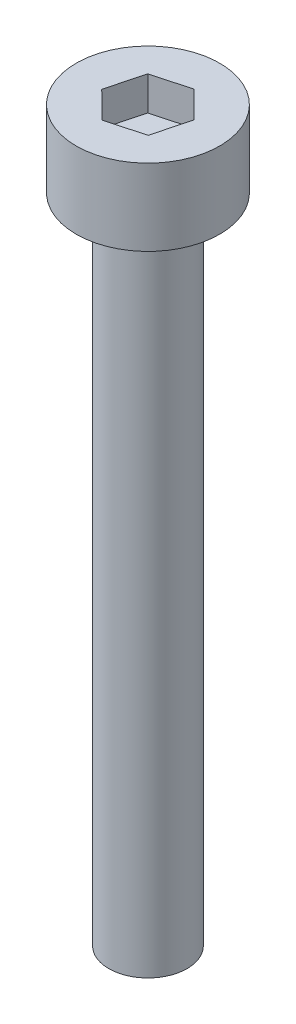
ISO-10303-21;
HEADER;
FILE_DESCRIPTION(('STEP AP214'),'2;1');
FILE_NAME('part.step','',(''),(''),'','','');
FILE_SCHEMA(('AUTOMOTIVE_DESIGN { 1 0 10303 214 1 1 1 1 }'));
ENDSEC;
DATA;
#1=APPLICATION_CONTEXT('core data for automotive mechanical design processes');
#2=APPLICATION_PROTOCOL_DEFINITION('international standard','automotive_design',2000,#1);
#3=PRODUCT_CONTEXT('',#1,'mechanical');
#4=PRODUCT('Part','Part','',(#3));
#5=PRODUCT_RELATED_PRODUCT_CATEGORY('part','',(#4));
#6=PRODUCT_DEFINITION_FORMATION('','',#4);
#7=PRODUCT_DEFINITION_CONTEXT('part definition',#1,'design');
#8=PRODUCT_DEFINITION('design','',#6,#7);
#9=PRODUCT_DEFINITION_SHAPE('','',#8);
#10=(LENGTH_UNIT() NAMED_UNIT(*) SI_UNIT(.MILLI.,.METRE.));
#11=(NAMED_UNIT(*) PLANE_ANGLE_UNIT() SI_UNIT($,.RADIAN.));
#12=(NAMED_UNIT(*) SI_UNIT($,.STERADIAN.) SOLID_ANGLE_UNIT());
#13=UNCERTAINTY_MEASURE_WITH_UNIT(LENGTH_MEASURE(1.E-05),#10,'distance_accuracy_value','');
#14=(GEOMETRIC_REPRESENTATION_CONTEXT(3) GLOBAL_UNCERTAINTY_ASSIGNED_CONTEXT((#13)) GLOBAL_UNIT_ASSIGNED_CONTEXT((#10,
#11,#12)) REPRESENTATION_CONTEXT('',''));
#15=CARTESIAN_POINT('',(0.,0.,0.));
#16=DIRECTION('',(0.,0.,1.));
#17=DIRECTION('',(1.,0.,0.));
#18=AXIS2_PLACEMENT_3D('',#15,#16,#17);
#19=CARTESIAN_POINT('',(0.,25.,0.));
#20=DIRECTION('',(0.,-1.,0.));
#21=DIRECTION('',(0.,0.,-1.));
#22=AXIS2_PLACEMENT_3D('',#19,#20,#21);
#23=CYLINDRICAL_SURFACE('',#22,1.5);
#24=CARTESIAN_POINT('',(0.,25.,0.));
#25=DIRECTION('',(0.,1.,0.));
#26=DIRECTION('',(0.,0.,1.));
#27=AXIS2_PLACEMENT_3D('',#24,#25,#26);
#28=CIRCLE('',#27,1.5);
#29=CARTESIAN_POINT('',(0.,25.,1.5));
#30=VERTEX_POINT('',#29);
#31=EDGE_CURVE('E11',#30,#30,#28,.T.);
#32=ORIENTED_EDGE('',*,*,#31,.F.);
#33=EDGE_LOOP('',(#32));
#34=FACE_BOUND('',#33,.T.);
#35=CARTESIAN_POINT('',(0.,0.,0.));
#36=DIRECTION('',(0.,1.,0.));
#37=DIRECTION('',(0.,0.,1.));
#38=AXIS2_PLACEMENT_3D('',#35,#36,#37);
#39=CIRCLE('',#38,1.5);
#40=CARTESIAN_POINT('',(0.,0.,1.5));
#41=VERTEX_POINT('',#40);
#42=EDGE_CURVE('E42',#41,#41,#39,.T.);
#43=ORIENTED_EDGE('',*,*,#42,.T.);
#44=EDGE_LOOP('',(#43));
#45=FACE_BOUND('',#44,.T.);
#46=ADVANCED_FACE('F39',(#34,#45),#23,.T.);
#47=CARTESIAN_POINT('',(0.,0.,0.));
#48=DIRECTION('',(0.,1.,0.));
#49=DIRECTION('',(0.,0.,1.));
#50=AXIS2_PLACEMENT_3D('',#47,#48,#49);
#51=PLANE('',#50);
#52=ORIENTED_EDGE('',*,*,#42,.F.);
#53=EDGE_LOOP('',(#52));
#54=FACE_BOUND('',#53,.T.);
#55=ADVANCED_FACE('F189',(#54),#51,.F.);
#56=CARTESIAN_POINT('',(0.,27.93,0.));
#57=DIRECTION('',(0.,-1.,0.));
#58=DIRECTION('',(0.,0.,-1.));
#59=AXIS2_PLACEMENT_3D('',#56,#57,#58);
#60=CYLINDRICAL_SURFACE('',#59,2.75);
#61=CARTESIAN_POINT('',(0.,27.93,0.));
#62=DIRECTION('',(0.,1.,0.));
#63=DIRECTION('',(0.,0.,1.));
#64=AXIS2_PLACEMENT_3D('',#61,#62,#63);
#65=CIRCLE('',#64,2.75);
#66=CARTESIAN_POINT('',(0.,27.93,2.75));
#67=VERTEX_POINT('',#66);
#68=EDGE_CURVE('E163',#67,#67,#65,.T.);
#69=ORIENTED_EDGE('',*,*,#68,.F.);
#70=EDGE_LOOP('',(#69));
#71=FACE_BOUND('',#70,.T.);
#72=CARTESIAN_POINT('',(0.,25.,0.));
#73=DIRECTION('',(0.,1.,0.));
#74=DIRECTION('',(0.,0.,1.));
#75=AXIS2_PLACEMENT_3D('',#72,#73,#74);
#76=CIRCLE('',#75,2.75);
#77=CARTESIAN_POINT('',(0.,25.,2.75));
#78=VERTEX_POINT('',#77);
#79=EDGE_CURVE('E153',#78,#78,#76,.T.);
#80=ORIENTED_EDGE('',*,*,#79,.T.);
#81=EDGE_LOOP('',(#80));
#82=FACE_BOUND('',#81,.T.);
#83=ADVANCED_FACE('F171',(#71,#82),#60,.T.);
#84=CARTESIAN_POINT('',(0.,27.93,0.));
#85=DIRECTION('',(0.,1.,0.));
#86=DIRECTION('',(0.,0.,1.));
#87=AXIS2_PLACEMENT_3D('',#84,#85,#86);
#88=PLANE('',#87);
#89=DIRECTION('',(0.965060636483616,0.,-0.262026654960595));
#90=VECTOR('',#89,1.);
#91=CARTESIAN_POINT('',(-0.368939204121915,27.93,1.39542724532497));
#92=LINE('',#91,#90);
#93=CARTESIAN_POINT('',(-0.368939204121915,27.93,1.39542724532497));
#94=VERTEX_POINT('',#93);
#95=CARTESIAN_POINT('',(1.0240058415234,27.93,1.01722434588407));
#96=VERTEX_POINT('',#95);
#97=EDGE_CURVE('E54',#94,#96,#92,.T.);
#98=ORIENTED_EDGE('',*,*,#97,.F.);
#99=DIRECTION('',(0.709452057906343,0.,0.704753699906893));
#100=VECTOR('',#99,1.);
#101=CARTESIAN_POINT('',(-1.39294504564532,27.93,0.378202899440891));
#102=LINE('',#101,#100);
#103=CARTESIAN_POINT('',(-1.39294504564532,27.93,0.378202899440891));
#104=VERTEX_POINT('',#103);
#105=EDGE_CURVE('E147',#104,#94,#102,.T.);
#106=ORIENTED_EDGE('',*,*,#105,.F.);
#107=DIRECTION('',(-0.255608578577273,0.,0.966780354867488));
#108=VECTOR('',#107,1.);
#109=CARTESIAN_POINT('',(-1.0240058415234,27.93,-1.01722434588407));
#110=LINE('',#109,#108);
#111=CARTESIAN_POINT('',(-1.0240058415234,27.93,-1.01722434588407));
#112=VERTEX_POINT('',#111);
#113=EDGE_CURVE('E144',#112,#104,#110,.T.);
#114=ORIENTED_EDGE('',*,*,#113,.F.);
#115=DIRECTION('',(-0.965060636483616,0.,0.262026654960595));
#116=VECTOR('',#115,1.);
#117=CARTESIAN_POINT('',(0.368939204121915,27.93,-1.39542724532496));
#118=LINE('',#117,#116);
#119=CARTESIAN_POINT('',(0.368939204121915,27.93,-1.39542724532496));
#120=VERTEX_POINT('',#119);
#121=EDGE_CURVE('E102',#120,#112,#118,.T.);
#122=ORIENTED_EDGE('',*,*,#121,.F.);
#123=DIRECTION('',(-0.709452057906343,0.,-0.704753699906893));
#124=VECTOR('',#123,1.);
#125=CARTESIAN_POINT('',(1.39294504564532,27.93,-0.378202899440891));
#126=LINE('',#125,#124);
#127=CARTESIAN_POINT('',(1.39294504564532,27.93,-0.378202899440891));
#128=VERTEX_POINT('',#127);
#129=EDGE_CURVE('E138',#128,#120,#126,.T.);
#130=ORIENTED_EDGE('',*,*,#129,.F.);
#131=DIRECTION('',(0.255608578577273,0.,-0.966780354867488));
#132=VECTOR('',#131,1.);
#133=CARTESIAN_POINT('',(1.0240058415234,27.93,1.01722434588407));
#134=LINE('',#133,#132);
#135=EDGE_CURVE('E134',#96,#128,#134,.T.);
#136=ORIENTED_EDGE('',*,*,#135,.F.);
#137=EDGE_LOOP('',(#98,#106,#114,#122,#130,#136));
#138=FACE_BOUND('',#137,.T.);
#139=ORIENTED_EDGE('',*,*,#68,.T.);
#140=EDGE_LOOP('',(#139));
#141=FACE_BOUND('',#140,.T.);
#142=ADVANCED_FACE('F176',(#138,#141),#88,.T.);
#143=CARTESIAN_POINT('',(0.,25.,0.));
#144=DIRECTION('',(0.,1.,0.));
#145=DIRECTION('',(0.,0.,1.));
#146=AXIS2_PLACEMENT_3D('',#143,#144,#145);
#147=PLANE('',#146);
#148=ORIENTED_EDGE('',*,*,#31,.T.);
#149=EDGE_LOOP('',(#148));
#150=FACE_BOUND('',#149,.T.);
#151=ORIENTED_EDGE('',*,*,#79,.F.);
#152=EDGE_LOOP('',(#151));
#153=FACE_BOUND('',#152,.T.);
#154=ADVANCED_FACE('F173',(#150,#153),#147,.F.);
#155=CARTESIAN_POINT('',(-0.368939204121915,26.63,1.39542724532497));
#156=DIRECTION('',(0.262026654960595,0.,0.965060636483616));
#157=DIRECTION('',(0.965060636483616,0.,-0.262026654960595));
#158=AXIS2_PLACEMENT_3D('',#155,#156,#157);
#159=PLANE('',#158);
#160=ORIENTED_EDGE('',*,*,#97,.T.);
#161=DIRECTION('',(0.,1.,0.));
#162=VECTOR('',#161,1.);
#163=CARTESIAN_POINT('',(1.0240058415234,26.63,1.01722434588407));
#164=LINE('',#163,#162);
#165=CARTESIAN_POINT('',(1.0240058415234,26.63,1.01722434588407));
#166=VERTEX_POINT('',#165);
#167=EDGE_CURVE('E84',#166,#96,#164,.T.);
#168=ORIENTED_EDGE('',*,*,#167,.F.);
#169=DIRECTION('',(0.965060636483616,0.,-0.262026654960595));
#170=VECTOR('',#169,1.);
#171=CARTESIAN_POINT('',(-0.368939204121915,26.63,1.39542724532497));
#172=LINE('',#171,#170);
#173=CARTESIAN_POINT('',(-0.368939204121915,26.63,1.39542724532497));
#174=VERTEX_POINT('',#173);
#175=EDGE_CURVE('E150',#174,#166,#172,.T.);
#176=ORIENTED_EDGE('',*,*,#175,.F.);
#177=DIRECTION('',(0.,1.,0.));
#178=VECTOR('',#177,1.);
#179=CARTESIAN_POINT('',(-0.368939204121915,26.63,1.39542724532497));
#180=LINE('',#179,#178);
#181=EDGE_CURVE('E62',#174,#94,#180,.T.);
#182=ORIENTED_EDGE('',*,*,#181,.T.);
#183=EDGE_LOOP('',(#160,#168,#176,#182));
#184=FACE_BOUND('',#183,.T.);
#185=ADVANCED_FACE('F175',(#184),#159,.F.);
#186=CARTESIAN_POINT('',(-1.39294504564532,26.63,0.378202899440891));
#187=DIRECTION('',(-0.704753699906893,0.,0.709452057906343));
#188=DIRECTION('',(0.709452057906343,0.,0.704753699906893));
#189=AXIS2_PLACEMENT_3D('',#186,#187,#188);
#190=PLANE('',#189);
#191=ORIENTED_EDGE('',*,*,#105,.T.);
#192=ORIENTED_EDGE('',*,*,#181,.F.);
#193=DIRECTION('',(0.709452057906343,0.,0.704753699906893));
#194=VECTOR('',#193,1.);
#195=CARTESIAN_POINT('',(-1.39294504564532,26.63,0.378202899440891));
#196=LINE('',#195,#194);
#197=CARTESIAN_POINT('',(-1.39294504564532,26.63,0.378202899440891));
#198=VERTEX_POINT('',#197);
#199=EDGE_CURVE('E116',#198,#174,#196,.T.);
#200=ORIENTED_EDGE('',*,*,#199,.F.);
#201=DIRECTION('',(0.,1.,0.));
#202=VECTOR('',#201,1.);
#203=CARTESIAN_POINT('',(-1.39294504564532,26.63,0.378202899440891));
#204=LINE('',#203,#202);
#205=EDGE_CURVE('E107',#198,#104,#204,.T.);
#206=ORIENTED_EDGE('',*,*,#205,.T.);
#207=EDGE_LOOP('',(#191,#192,#200,#206));
#208=FACE_BOUND('',#207,.T.);
#209=ADVANCED_FACE('F183',(#208),#190,.F.);
#210=CARTESIAN_POINT('',(-1.0240058415234,26.63,-1.01722434588407));
#211=DIRECTION('',(-0.966780354867488,0.,-0.255608578577273));
#212=DIRECTION('',(-0.255608578577273,0.,0.966780354867488));
#213=AXIS2_PLACEMENT_3D('',#210,#211,#212);
#214=PLANE('',#213);
#215=ORIENTED_EDGE('',*,*,#113,.T.);
#216=ORIENTED_EDGE('',*,*,#205,.F.);
#217=DIRECTION('',(-0.255608578577273,0.,0.966780354867488));
#218=VECTOR('',#217,1.);
#219=CARTESIAN_POINT('',(-1.0240058415234,26.63,-1.01722434588407));
#220=LINE('',#219,#218);
#221=CARTESIAN_POINT('',(-1.0240058415234,26.63,-1.01722434588407));
#222=VERTEX_POINT('',#221);
#223=EDGE_CURVE('E111',#222,#198,#220,.T.);
#224=ORIENTED_EDGE('',*,*,#223,.F.);
#225=DIRECTION('',(0.,1.,0.));
#226=VECTOR('',#225,1.);
#227=CARTESIAN_POINT('',(-1.0240058415234,26.63,-1.01722434588407));
#228=LINE('',#227,#226);
#229=EDGE_CURVE('E95',#222,#112,#228,.T.);
#230=ORIENTED_EDGE('',*,*,#229,.T.);
#231=EDGE_LOOP('',(#215,#216,#224,#230));
#232=FACE_BOUND('',#231,.T.);
#233=ADVANCED_FACE('F112',(#232),#214,.F.);
#234=CARTESIAN_POINT('',(0.368939204121915,26.63,-1.39542724532496));
#235=DIRECTION('',(-0.262026654960595,0.,-0.965060636483616));
#236=DIRECTION('',(-0.965060636483616,0.,0.262026654960595));
#237=AXIS2_PLACEMENT_3D('',#234,#235,#236);
#238=PLANE('',#237);
#239=ORIENTED_EDGE('',*,*,#121,.T.);
#240=ORIENTED_EDGE('',*,*,#229,.F.);
#241=DIRECTION('',(-0.965060636483616,0.,0.262026654960595));
#242=VECTOR('',#241,1.);
#243=CARTESIAN_POINT('',(0.368939204121915,26.63,-1.39542724532496));
#244=LINE('',#243,#242);
#245=CARTESIAN_POINT('',(0.368939204121915,26.63,-1.39542724532496));
#246=VERTEX_POINT('',#245);
#247=EDGE_CURVE('E99',#246,#222,#244,.T.);
#248=ORIENTED_EDGE('',*,*,#247,.F.);
#249=DIRECTION('',(0.,1.,0.));
#250=VECTOR('',#249,1.);
#251=CARTESIAN_POINT('',(0.368939204121915,26.63,-1.39542724532496));
#252=LINE('',#251,#250);
#253=EDGE_CURVE('E108',#246,#120,#252,.T.);
#254=ORIENTED_EDGE('',*,*,#253,.T.);
#255=EDGE_LOOP('',(#239,#240,#248,#254));
#256=FACE_BOUND('',#255,.T.);
#257=ADVANCED_FACE('F97',(#256),#238,.F.);
#258=CARTESIAN_POINT('',(1.39294504564532,26.63,-0.378202899440891));
#259=DIRECTION('',(0.704753699906893,0.,-0.709452057906343));
#260=DIRECTION('',(-0.709452057906343,0.,-0.704753699906893));
#261=AXIS2_PLACEMENT_3D('',#258,#259,#260);
#262=PLANE('',#261);
#263=ORIENTED_EDGE('',*,*,#129,.T.);
#264=ORIENTED_EDGE('',*,*,#253,.F.);
#265=DIRECTION('',(-0.709452057906343,0.,-0.704753699906893));
#266=VECTOR('',#265,1.);
#267=CARTESIAN_POINT('',(1.39294504564532,26.63,-0.378202899440891));
#268=LINE('',#267,#266);
#269=CARTESIAN_POINT('',(1.39294504564532,26.63,-0.378202899440891));
#270=VERTEX_POINT('',#269);
#271=EDGE_CURVE('E122',#270,#246,#268,.T.);
#272=ORIENTED_EDGE('',*,*,#271,.F.);
#273=DIRECTION('',(0.,1.,0.));
#274=VECTOR('',#273,1.);
#275=CARTESIAN_POINT('',(1.39294504564532,26.63,-0.378202899440891));
#276=LINE('',#275,#274);
#277=EDGE_CURVE('E158',#270,#128,#276,.T.);
#278=ORIENTED_EDGE('',*,*,#277,.T.);
#279=EDGE_LOOP('',(#263,#264,#272,#278));
#280=FACE_BOUND('',#279,.T.);
#281=ADVANCED_FACE('F245',(#280),#262,.F.);
#282=CARTESIAN_POINT('',(1.0240058415234,26.63,1.01722434588407));
#283=DIRECTION('',(0.966780354867488,0.,0.255608578577273));
#284=DIRECTION('',(0.255608578577273,0.,-0.966780354867488));
#285=AXIS2_PLACEMENT_3D('',#282,#283,#284);
#286=PLANE('',#285);
#287=ORIENTED_EDGE('',*,*,#135,.T.);
#288=ORIENTED_EDGE('',*,*,#277,.F.);
#289=DIRECTION('',(0.255608578577273,0.,-0.966780354867488));
#290=VECTOR('',#289,1.);
#291=CARTESIAN_POINT('',(1.0240058415234,26.63,1.01722434588407));
#292=LINE('',#291,#290);
#293=EDGE_CURVE('E126',#166,#270,#292,.T.);
#294=ORIENTED_EDGE('',*,*,#293,.F.);
#295=ORIENTED_EDGE('',*,*,#167,.T.);
#296=EDGE_LOOP('',(#287,#288,#294,#295));
#297=FACE_BOUND('',#296,.T.);
#298=ADVANCED_FACE('F254',(#297),#286,.F.);
#299=CARTESIAN_POINT('',(0.,26.63,0.));
#300=DIRECTION('',(0.,1.,0.));
#301=DIRECTION('',(0.,0.,1.));
#302=AXIS2_PLACEMENT_3D('',#299,#300,#301);
#303=PLANE('',#302);
#304=ORIENTED_EDGE('',*,*,#175,.T.);
#305=ORIENTED_EDGE('',*,*,#293,.T.);
#306=ORIENTED_EDGE('',*,*,#271,.T.);
#307=ORIENTED_EDGE('',*,*,#247,.T.);
#308=ORIENTED_EDGE('',*,*,#223,.T.);
#309=ORIENTED_EDGE('',*,*,#199,.T.);
#310=EDGE_LOOP('',(#304,#305,#306,#307,#308,#309));
#311=FACE_BOUND('',#310,.T.);
#312=ADVANCED_FACE('F119',(#311),#303,.T.);
#313=CLOSED_SHELL('',(#46,#55,#83,#142,#154,#185,#209,#233,#257,#281,#298,#312));
#314=MANIFOLD_SOLID_BREP('B2',#313);
#315=ADVANCED_BREP_SHAPE_REPRESENTATION('',(#18,#314),#14);
#316=SHAPE_DEFINITION_REPRESENTATION(#9,#315);
ENDSEC;
END-ISO-10303-21;
